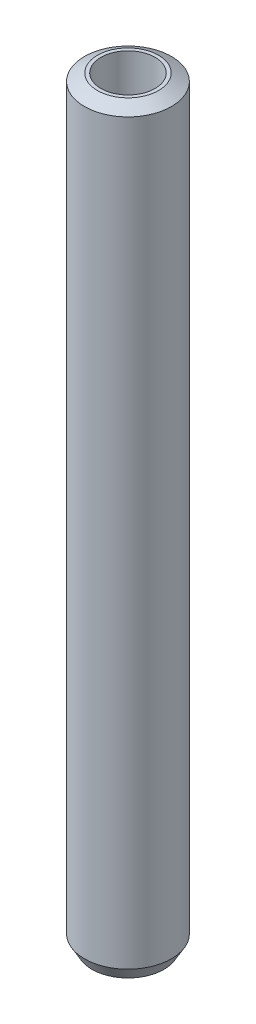
ISO-10303-21;
HEADER;
FILE_DESCRIPTION(('STEP AP214'),'2;1');
FILE_NAME('part.step','',(''),(''),'','','');
FILE_SCHEMA(('AUTOMOTIVE_DESIGN { 1 0 10303 214 1 1 1 1 }'));
ENDSEC;
DATA;
#1=APPLICATION_CONTEXT('core data for automotive mechanical design processes');
#2=APPLICATION_PROTOCOL_DEFINITION('international standard','automotive_design',2000,#1);
#3=PRODUCT_CONTEXT('',#1,'mechanical');
#4=PRODUCT('Part','Part','',(#3));
#5=PRODUCT_RELATED_PRODUCT_CATEGORY('part','',(#4));
#6=PRODUCT_DEFINITION_FORMATION('','',#4);
#7=PRODUCT_DEFINITION_CONTEXT('part definition',#1,'design');
#8=PRODUCT_DEFINITION('design','',#6,#7);
#9=PRODUCT_DEFINITION_SHAPE('','',#8);
#10=(LENGTH_UNIT() NAMED_UNIT(*) SI_UNIT(.MILLI.,.METRE.));
#11=(NAMED_UNIT(*) PLANE_ANGLE_UNIT() SI_UNIT($,.RADIAN.));
#12=(NAMED_UNIT(*) SI_UNIT($,.STERADIAN.) SOLID_ANGLE_UNIT());
#13=UNCERTAINTY_MEASURE_WITH_UNIT(LENGTH_MEASURE(1.E-05),#10,'distance_accuracy_value','');
#14=(GEOMETRIC_REPRESENTATION_CONTEXT(3) GLOBAL_UNCERTAINTY_ASSIGNED_CONTEXT((#13)) GLOBAL_UNIT_ASSIGNED_CONTEXT((#10,
#11,#12)) REPRESENTATION_CONTEXT('',''));
#15=CARTESIAN_POINT('',(0.,0.,0.));
#16=DIRECTION('',(0.,0.,1.));
#17=DIRECTION('',(1.,0.,0.));
#18=AXIS2_PLACEMENT_3D('',#15,#16,#17);
#19=CARTESIAN_POINT('',(0.,567.153264696292,0.));
#20=DIRECTION('',(0.,-1.,0.));
#21=DIRECTION('',(0.,0.,-1.));
#22=AXIS2_PLACEMENT_3D('',#19,#20,#21);
#23=CYLINDRICAL_SURFACE('',#22,32.5);
#24=CARTESIAN_POINT('',(0.,561.596669792453,0.));
#25=DIRECTION('',(0.,1.,0.));
#26=DIRECTION('',(0.,0.,1.));
#27=AXIS2_PLACEMENT_3D('',#24,#25,#26);
#28=CIRCLE('',#27,32.5);
#29=CARTESIAN_POINT('',(0.,561.596669792453,32.5));
#30=VERTEX_POINT('',#29);
#31=EDGE_CURVE('E50',#30,#30,#28,.F.);
#32=ORIENTED_EDGE('',*,*,#31,.T.);
#33=EDGE_LOOP('',(#32));
#34=FACE_BOUND('',#33,.T.);
#35=CARTESIAN_POINT('',(0.,9.62430469052689,0.));
#36=DIRECTION('',(0.,1.,0.));
#37=DIRECTION('',(0.,0.,1.));
#38=AXIS2_PLACEMENT_3D('',#35,#36,#37);
#39=CIRCLE('',#38,32.5);
#40=CARTESIAN_POINT('',(0.,9.62430469052689,32.5));
#41=VERTEX_POINT('',#40);
#42=EDGE_CURVE('E51',#41,#41,#39,.T.);
#43=ORIENTED_EDGE('',*,*,#42,.T.);
#44=EDGE_LOOP('',(#43));
#45=FACE_BOUND('',#44,.T.);
#46=ADVANCED_FACE('F39',(#34,#45),#23,.T.);
#47=CARTESIAN_POINT('',(0.,567.153264696292,0.));
#48=DIRECTION('',(0.,1.,0.));
#49=DIRECTION('',(0.,0.,1.));
#50=AXIS2_PLACEMENT_3D('',#47,#48,#49);
#51=PLANE('',#50);
#52=CARTESIAN_POINT('',(0.,567.153264696292,0.));
#53=DIRECTION('',(0.,1.,0.));
#54=DIRECTION('',(0.,0.,1.));
#55=AXIS2_PLACEMENT_3D('',#52,#53,#54);
#56=CIRCLE('',#55,22.8756953094735);
#57=CARTESIAN_POINT('',(0.,567.153264696292,22.8756953094735));
#58=VERTEX_POINT('',#57);
#59=EDGE_CURVE('E54',#58,#58,#56,.T.);
#60=ORIENTED_EDGE('',*,*,#59,.T.);
#61=EDGE_LOOP('',(#60));
#62=FACE_BOUND('',#61,.T.);
#63=CARTESIAN_POINT('',(0.,567.153264696292,0.));
#64=DIRECTION('',(0.,1.,0.));
#65=DIRECTION('',(0.,0.,1.));
#66=AXIS2_PLACEMENT_3D('',#63,#64,#65);
#67=CIRCLE('',#66,20.2495594103089);
#68=CARTESIAN_POINT('',(0.,567.153264696292,20.2495594103089));
#69=VERTEX_POINT('',#68);
#70=EDGE_CURVE('E58',#69,#69,#67,.T.);
#71=ORIENTED_EDGE('',*,*,#70,.F.);
#72=EDGE_LOOP('',(#71));
#73=FACE_BOUND('',#72,.T.);
#74=ADVANCED_FACE('F69',(#62,#73),#51,.T.);
#75=CARTESIAN_POINT('',(0.,0.,0.));
#76=DIRECTION('',(0.,1.,0.));
#77=DIRECTION('',(0.,0.,1.));
#78=AXIS2_PLACEMENT_3D('',#75,#76,#77);
#79=PLANE('',#78);
#80=CARTESIAN_POINT('',(0.,0.,0.));
#81=DIRECTION('',(0.,1.,0.));
#82=DIRECTION('',(0.,0.,1.));
#83=AXIS2_PLACEMENT_3D('',#80,#81,#82);
#84=CIRCLE('',#83,26.9434050961613);
#85=CARTESIAN_POINT('',(0.,0.,26.9434050961613));
#86=VERTEX_POINT('',#85);
#87=EDGE_CURVE('E10',#86,#86,#84,.F.);
#88=ORIENTED_EDGE('',*,*,#87,.T.);
#89=EDGE_LOOP('',(#88));
#90=FACE_BOUND('',#89,.T.);
#91=CARTESIAN_POINT('',(0.,0.,0.));
#92=DIRECTION('',(0.,1.,0.));
#93=DIRECTION('',(0.,0.,1.));
#94=AXIS2_PLACEMENT_3D('',#91,#92,#93);
#95=CIRCLE('',#94,20.2495594103089);
#96=CARTESIAN_POINT('',(0.,0.,20.2495594103089));
#97=VERTEX_POINT('',#96);
#98=EDGE_CURVE('E63',#97,#97,#95,.T.);
#99=ORIENTED_EDGE('',*,*,#98,.T.);
#100=EDGE_LOOP('',(#99));
#101=FACE_BOUND('',#100,.T.);
#102=ADVANCED_FACE('F75',(#90,#101),#79,.F.);
#103=CARTESIAN_POINT('',(0.,567.153264696292,0.));
#104=DIRECTION('',(0.,-1.,0.));
#105=DIRECTION('',(0.,0.,-1.));
#106=AXIS2_PLACEMENT_3D('',#103,#104,#105);
#107=CYLINDRICAL_SURFACE('',#106,20.2495594103089);
#108=ORIENTED_EDGE('',*,*,#70,.T.);
#109=EDGE_LOOP('',(#108));
#110=FACE_BOUND('',#109,.T.);
#111=ORIENTED_EDGE('',*,*,#98,.F.);
#112=EDGE_LOOP('',(#111));
#113=FACE_BOUND('',#112,.T.);
#114=ADVANCED_FACE('F70',(#110,#113),#107,.F.);
#115=CARTESIAN_POINT('',(0.,567.153264696292,0.));
#116=DIRECTION('',(0.,-1.,0.));
#117=DIRECTION('',(0.,0.,-1.));
#118=AXIS2_PLACEMENT_3D('',#115,#116,#117);
#119=CONICAL_SURFACE('',#118,22.8756953094735,1.0471975511966);
#120=ORIENTED_EDGE('',*,*,#31,.F.);
#121=EDGE_LOOP('',(#120));
#122=FACE_BOUND('',#121,.T.);
#123=ORIENTED_EDGE('',*,*,#59,.F.);
#124=EDGE_LOOP('',(#123));
#125=FACE_BOUND('',#124,.T.);
#126=ADVANCED_FACE('F81',(#122,#125),#119,.T.);
#127=CARTESIAN_POINT('',(0.,9.62430469052689,0.));
#128=DIRECTION('',(0.,1.,0.));
#129=DIRECTION('',(0.,0.,1.));
#130=AXIS2_PLACEMENT_3D('',#127,#128,#129);
#131=CONICAL_SURFACE('',#130,32.5,0.523598775598303);
#132=ORIENTED_EDGE('',*,*,#87,.F.);
#133=EDGE_LOOP('',(#132));
#134=FACE_BOUND('',#133,.T.);
#135=ORIENTED_EDGE('',*,*,#42,.F.);
#136=EDGE_LOOP('',(#135));
#137=FACE_BOUND('',#136,.T.);
#138=ADVANCED_FACE('F45',(#134,#137),#131,.T.);
#139=CLOSED_SHELL('',(#46,#74,#102,#114,#126,#138));
#140=MANIFOLD_SOLID_BREP('B2',#139);
#141=ADVANCED_BREP_SHAPE_REPRESENTATION('',(#18,#140),#14);
#142=SHAPE_DEFINITION_REPRESENTATION(#9,#141);
ENDSEC;
END-ISO-10303-21;
